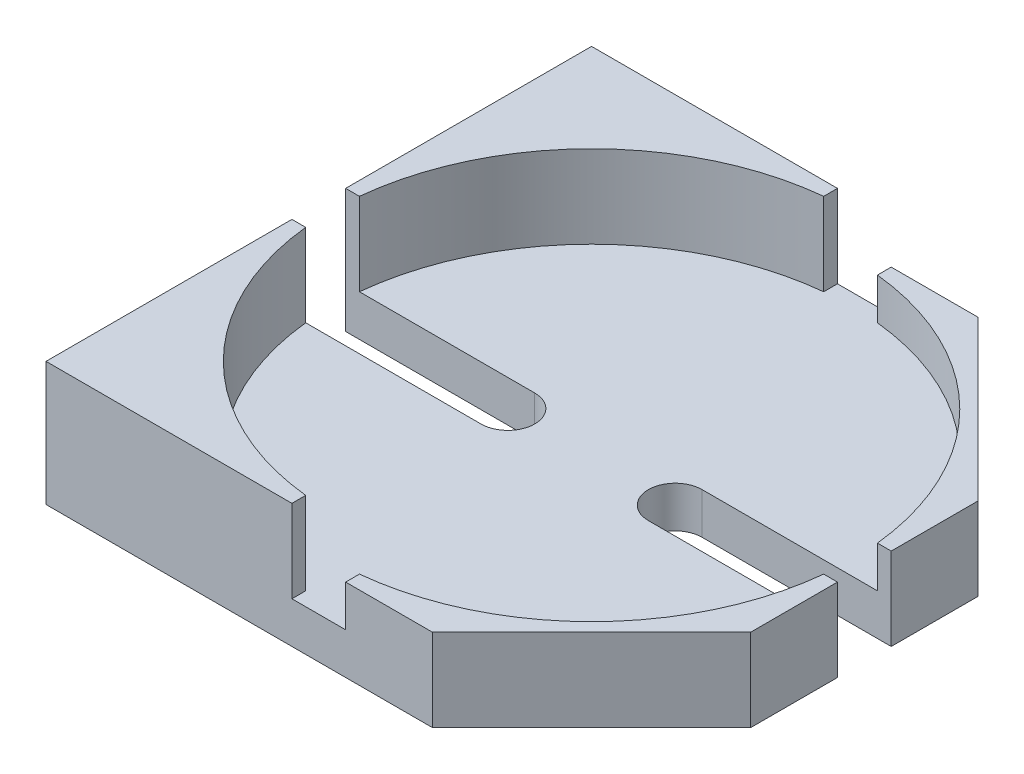
ISO-10303-21;
HEADER;
FILE_DESCRIPTION(('STEP AP214'),'2;1');
FILE_NAME('part.step','',(''),(''),'','','');
FILE_SCHEMA(('AUTOMOTIVE_DESIGN { 1 0 10303 214 1 1 1 1 }'));
ENDSEC;
DATA;
#1=APPLICATION_CONTEXT('core data for automotive mechanical design processes');
#2=APPLICATION_PROTOCOL_DEFINITION('international standard','automotive_design',2000,#1);
#3=PRODUCT_CONTEXT('',#1,'mechanical');
#4=PRODUCT('Part','Part','',(#3));
#5=PRODUCT_RELATED_PRODUCT_CATEGORY('part','',(#4));
#6=PRODUCT_DEFINITION_FORMATION('','',#4);
#7=PRODUCT_DEFINITION_CONTEXT('part definition',#1,'design');
#8=PRODUCT_DEFINITION('design','',#6,#7);
#9=PRODUCT_DEFINITION_SHAPE('','',#8);
#10=(LENGTH_UNIT() NAMED_UNIT(*) SI_UNIT(.MILLI.,.METRE.));
#11=(NAMED_UNIT(*) PLANE_ANGLE_UNIT() SI_UNIT($,.RADIAN.));
#12=(NAMED_UNIT(*) SI_UNIT($,.STERADIAN.) SOLID_ANGLE_UNIT());
#13=UNCERTAINTY_MEASURE_WITH_UNIT(LENGTH_MEASURE(1.E-05),#10,'distance_accuracy_value','');
#14=(GEOMETRIC_REPRESENTATION_CONTEXT(3) GLOBAL_UNCERTAINTY_ASSIGNED_CONTEXT((#13)) GLOBAL_UNIT_ASSIGNED_CONTEXT((#10,
#11,#12)) REPRESENTATION_CONTEXT('',''));
#15=CARTESIAN_POINT('',(0.,0.,0.));
#16=DIRECTION('',(0.,0.,1.));
#17=DIRECTION('',(1.,0.,0.));
#18=AXIS2_PLACEMENT_3D('',#15,#16,#17);
#19=CARTESIAN_POINT('',(0.,1.,0.));
#20=DIRECTION('',(0.,1.,0.));
#21=DIRECTION('',(1.,0.,0.));
#22=AXIS2_PLACEMENT_3D('',#19,#20,#21);
#23=PLANE('',#22);
#24=CARTESIAN_POINT('',(0.,1.,0.));
#25=DIRECTION('',(0.,1.,0.));
#26=DIRECTION('',(0.,0.,1.));
#27=AXIS2_PLACEMENT_3D('',#24,#25,#26);
#28=CIRCLE('',#27,3.15);
#29=CARTESIAN_POINT('',(0.325000000000011,1.,3.13318926973778));
#30=VERTEX_POINT('',#29);
#31=CARTESIAN_POINT('',(3.13318926973778,1.,0.325));
#32=VERTEX_POINT('',#31);
#33=EDGE_CURVE('E20',#30,#32,#28,.T.);
#34=ORIENTED_EDGE('',*,*,#33,.F.);
#35=DIRECTION('',(0.,0.,-1.));
#36=VECTOR('',#35,1.);
#37=CARTESIAN_POINT('',(0.325000000000011,1.,0.));
#38=LINE('',#37,#36);
#39=CARTESIAN_POINT('',(0.325000000000011,1.,3.3));
#40=VERTEX_POINT('',#39);
#41=EDGE_CURVE('E11',#40,#30,#38,.T.);
#42=ORIENTED_EDGE('',*,*,#41,.F.);
#43=DIRECTION('',(1.,0.,0.));
#44=VECTOR('',#43,1.);
#45=CARTESIAN_POINT('',(0.,1.,3.3));
#46=LINE('',#45,#44);
#47=CARTESIAN_POINT('',(1.37500000000002,1.,3.3));
#48=VERTEX_POINT('',#47);
#49=EDGE_CURVE('E322',#40,#48,#46,.T.);
#50=ORIENTED_EDGE('',*,*,#49,.T.);
#51=DIRECTION('',(0.707106781186544,0.,-0.707106781186552));
#52=VECTOR('',#51,1.);
#53=CARTESIAN_POINT('',(2.3375,1.,2.3375));
#54=LINE('',#53,#52);
#55=CARTESIAN_POINT('',(3.3,1.,1.375));
#56=VERTEX_POINT('',#55);
#57=EDGE_CURVE('E349',#48,#56,#54,.T.);
#58=ORIENTED_EDGE('',*,*,#57,.T.);
#59=DIRECTION('',(0.,0.,-1.));
#60=VECTOR('',#59,1.);
#61=CARTESIAN_POINT('',(3.3,1.,0.));
#62=LINE('',#61,#60);
#63=CARTESIAN_POINT('',(3.3,1.,0.325));
#64=VERTEX_POINT('',#63);
#65=EDGE_CURVE('E188',#56,#64,#62,.T.);
#66=ORIENTED_EDGE('',*,*,#65,.T.);
#67=DIRECTION('',(-1.,0.,0.));
#68=VECTOR('',#67,1.);
#69=CARTESIAN_POINT('',(0.,1.,0.325));
#70=LINE('',#69,#68);
#71=EDGE_CURVE('E184',#64,#32,#70,.T.);
#72=ORIENTED_EDGE('',*,*,#71,.T.);
#73=EDGE_LOOP('',(#34,#42,#50,#58,#66,#72));
#74=FACE_BOUND('',#73,.T.);
#75=ADVANCED_FACE('F17',(#74),#23,.T.);
#76=CARTESIAN_POINT('',(0.325000000000011,1.,0.));
#77=DIRECTION('',(-1.,0.,0.));
#78=DIRECTION('',(0.,0.,1.));
#79=AXIS2_PLACEMENT_3D('',#76,#77,#78);
#80=PLANE('',#79);
#81=DIRECTION('',(0.,0.,-1.));
#82=VECTOR('',#81,1.);
#83=CARTESIAN_POINT('',(0.325000000000011,0.5,0.));
#84=LINE('',#83,#82);
#85=CARTESIAN_POINT('',(0.325000000000011,0.5,3.3));
#86=VERTEX_POINT('',#85);
#87=CARTESIAN_POINT('',(0.325000000000011,0.5,3.13318926973778));
#88=VERTEX_POINT('',#87);
#89=EDGE_CURVE('E487',#86,#88,#84,.T.);
#90=ORIENTED_EDGE('',*,*,#89,.F.);
#91=DIRECTION('',(0.,-1.,0.));
#92=VECTOR('',#91,1.);
#93=CARTESIAN_POINT('',(0.325000000000011,1.,3.3));
#94=LINE('',#93,#92);
#95=EDGE_CURVE('E326',#40,#86,#94,.T.);
#96=ORIENTED_EDGE('',*,*,#95,.F.);
#97=ORIENTED_EDGE('',*,*,#41,.T.);
#98=DIRECTION('',(0.,-1.,0.));
#99=VECTOR('',#98,1.);
#100=CARTESIAN_POINT('',(0.325000000000011,1.,3.13318926973778));
#101=LINE('',#100,#99);
#102=EDGE_CURVE('E155',#30,#88,#101,.T.);
#103=ORIENTED_EDGE('',*,*,#102,.T.);
#104=EDGE_LOOP('',(#90,#96,#97,#103));
#105=FACE_BOUND('',#104,.T.);
#106=ADVANCED_FACE('F641',(#105),#80,.T.);
#107=CARTESIAN_POINT('',(0.,1.,0.));
#108=DIRECTION('',(0.,-1.,0.));
#109=DIRECTION('',(0.,0.,-1.));
#110=AXIS2_PLACEMENT_3D('',#107,#108,#109);
#111=CYLINDRICAL_SURFACE('',#110,3.15);
#112=CARTESIAN_POINT('',(0.,0.5,0.));
#113=DIRECTION('',(0.,1.,0.));
#114=DIRECTION('',(0.,0.,1.));
#115=AXIS2_PLACEMENT_3D('',#112,#113,#114);
#116=CIRCLE('',#115,3.15);
#117=CARTESIAN_POINT('',(3.13318926973778,0.5,0.325));
#118=VERTEX_POINT('',#117);
#119=EDGE_CURVE('E548',#88,#118,#116,.T.);
#120=ORIENTED_EDGE('',*,*,#119,.F.);
#121=ORIENTED_EDGE('',*,*,#102,.F.);
#122=ORIENTED_EDGE('',*,*,#33,.T.);
#123=DIRECTION('',(0.,-1.,0.));
#124=VECTOR('',#123,1.);
#125=CARTESIAN_POINT('',(3.13318926973778,1.,0.325));
#126=LINE('',#125,#124);
#127=EDGE_CURVE('E175',#32,#118,#126,.T.);
#128=ORIENTED_EDGE('',*,*,#127,.T.);
#129=EDGE_LOOP('',(#120,#121,#122,#128));
#130=FACE_BOUND('',#129,.T.);
#131=ADVANCED_FACE('F172',(#130),#111,.F.);
#132=CARTESIAN_POINT('',(0.,1.,0.));
#133=DIRECTION('',(0.,1.,0.));
#134=DIRECTION('',(1.,0.,0.));
#135=AXIS2_PLACEMENT_3D('',#132,#133,#134);
#136=PLANE('',#135);
#137=CARTESIAN_POINT('',(0.,1.,0.));
#138=DIRECTION('',(0.,1.,0.));
#139=DIRECTION('',(0.,0.,1.));
#140=AXIS2_PLACEMENT_3D('',#137,#138,#139);
#141=CIRCLE('',#140,3.15);
#142=CARTESIAN_POINT('',(3.13318926973778,1.,-0.325));
#143=VERTEX_POINT('',#142);
#144=CARTESIAN_POINT('',(0.325000000000005,1.,-3.13318926973778));
#145=VERTEX_POINT('',#144);
#146=EDGE_CURVE('E149',#143,#145,#141,.T.);
#147=ORIENTED_EDGE('',*,*,#146,.F.);
#148=DIRECTION('',(1.,0.,0.));
#149=VECTOR('',#148,1.);
#150=CARTESIAN_POINT('',(0.,1.,-0.325));
#151=LINE('',#150,#149);
#152=CARTESIAN_POINT('',(3.3,1.,-0.325));
#153=VERTEX_POINT('',#152);
#154=EDGE_CURVE('E227',#143,#153,#151,.T.);
#155=ORIENTED_EDGE('',*,*,#154,.T.);
#156=DIRECTION('',(0.,0.,-1.));
#157=VECTOR('',#156,1.);
#158=CARTESIAN_POINT('',(3.3,1.,0.));
#159=LINE('',#158,#157);
#160=CARTESIAN_POINT('',(3.3,1.,-1.375));
#161=VERTEX_POINT('',#160);
#162=EDGE_CURVE('E237',#153,#161,#159,.T.);
#163=ORIENTED_EDGE('',*,*,#162,.T.);
#164=DIRECTION('',(-0.707106781186549,0.,-0.707106781186546));
#165=VECTOR('',#164,1.);
#166=CARTESIAN_POINT('',(2.3375,1.,-2.3375));
#167=LINE('',#166,#165);
#168=CARTESIAN_POINT('',(1.375,1.,-3.3));
#169=VERTEX_POINT('',#168);
#170=EDGE_CURVE('E242',#161,#169,#167,.T.);
#171=ORIENTED_EDGE('',*,*,#170,.T.);
#172=DIRECTION('',(-1.,0.,0.));
#173=VECTOR('',#172,1.);
#174=CARTESIAN_POINT('',(0.,1.,-3.3));
#175=LINE('',#174,#173);
#176=CARTESIAN_POINT('',(0.325000000000005,1.,-3.3));
#177=VERTEX_POINT('',#176);
#178=EDGE_CURVE('E265',#169,#177,#175,.T.);
#179=ORIENTED_EDGE('',*,*,#178,.T.);
#180=DIRECTION('',(0.,0.,1.));
#181=VECTOR('',#180,1.);
#182=CARTESIAN_POINT('',(0.325000000000005,1.,0.));
#183=LINE('',#182,#181);
#184=EDGE_CURVE('E51',#177,#145,#183,.T.);
#185=ORIENTED_EDGE('',*,*,#184,.T.);
#186=EDGE_LOOP('',(#147,#155,#163,#171,#179,#185));
#187=FACE_BOUND('',#186,.T.);
#188=ADVANCED_FACE('F618',(#187),#136,.T.);
#189=CARTESIAN_POINT('',(0.325000000000005,1.,0.));
#190=DIRECTION('',(1.,0.,0.));
#191=DIRECTION('',(0.,1.,0.));
#192=AXIS2_PLACEMENT_3D('',#189,#190,#191);
#193=PLANE('',#192);
#194=DIRECTION('',(0.,0.,1.));
#195=VECTOR('',#194,1.);
#196=CARTESIAN_POINT('',(0.325000000000005,0.5,0.));
#197=LINE('',#196,#195);
#198=CARTESIAN_POINT('',(0.325000000000005,0.5,-3.3));
#199=VERTEX_POINT('',#198);
#200=CARTESIAN_POINT('',(0.325000000000005,0.5,-3.13318926973778));
#201=VERTEX_POINT('',#200);
#202=EDGE_CURVE('E520',#199,#201,#197,.T.);
#203=ORIENTED_EDGE('',*,*,#202,.T.);
#204=DIRECTION('',(0.,-1.,0.));
#205=VECTOR('',#204,1.);
#206=CARTESIAN_POINT('',(0.325000000000005,1.,-3.13318926973778));
#207=LINE('',#206,#205);
#208=EDGE_CURVE('E153',#145,#201,#207,.T.);
#209=ORIENTED_EDGE('',*,*,#208,.F.);
#210=ORIENTED_EDGE('',*,*,#184,.F.);
#211=DIRECTION('',(0.,-1.,0.));
#212=VECTOR('',#211,1.);
#213=CARTESIAN_POINT('',(0.325000000000005,1.,-3.3));
#214=LINE('',#213,#212);
#215=EDGE_CURVE('E261',#177,#199,#214,.T.);
#216=ORIENTED_EDGE('',*,*,#215,.T.);
#217=EDGE_LOOP('',(#203,#209,#210,#216));
#218=FACE_BOUND('',#217,.T.);
#219=ADVANCED_FACE('F617',(#218),#193,.F.);
#220=CARTESIAN_POINT('',(0.,1.,0.));
#221=DIRECTION('',(0.,-1.,0.));
#222=DIRECTION('',(0.,0.,-1.));
#223=AXIS2_PLACEMENT_3D('',#220,#221,#222);
#224=CYLINDRICAL_SURFACE('',#223,3.15);
#225=CARTESIAN_POINT('',(0.,0.5,0.));
#226=DIRECTION('',(0.,1.,0.));
#227=DIRECTION('',(0.,0.,1.));
#228=AXIS2_PLACEMENT_3D('',#225,#226,#227);
#229=CIRCLE('',#228,3.15);
#230=CARTESIAN_POINT('',(3.13318926973778,0.5,-0.325));
#231=VERTEX_POINT('',#230);
#232=EDGE_CURVE('E526',#231,#201,#229,.T.);
#233=ORIENTED_EDGE('',*,*,#232,.F.);
#234=DIRECTION('',(0.,-1.,0.));
#235=VECTOR('',#234,1.);
#236=CARTESIAN_POINT('',(3.13318926973778,1.,-0.325));
#237=LINE('',#236,#235);
#238=EDGE_CURVE('E228',#143,#231,#237,.T.);
#239=ORIENTED_EDGE('',*,*,#238,.F.);
#240=ORIENTED_EDGE('',*,*,#146,.T.);
#241=ORIENTED_EDGE('',*,*,#208,.T.);
#242=EDGE_LOOP('',(#233,#239,#240,#241));
#243=FACE_BOUND('',#242,.T.);
#244=ADVANCED_FACE('F654',(#243),#224,.F.);
#245=CARTESIAN_POINT('',(0.,1.5,0.));
#246=DIRECTION('',(0.,1.,0.));
#247=DIRECTION('',(1.,0.,0.));
#248=AXIS2_PLACEMENT_3D('',#245,#246,#247);
#249=PLANE('',#248);
#250=CARTESIAN_POINT('',(0.,1.5,0.));
#251=DIRECTION('',(0.,1.,0.));
#252=DIRECTION('',(0.,0.,1.));
#253=AXIS2_PLACEMENT_3D('',#250,#251,#252);
#254=CIRCLE('',#253,3.15);
#255=CARTESIAN_POINT('',(-3.13318926973778,1.5,0.325));
#256=VERTEX_POINT('',#255);
#257=CARTESIAN_POINT('',(-0.325,1.5,3.13318926973778));
#258=VERTEX_POINT('',#257);
#259=EDGE_CURVE('E108',#256,#258,#254,.T.);
#260=ORIENTED_EDGE('',*,*,#259,.F.);
#261=DIRECTION('',(-1.,0.,0.));
#262=VECTOR('',#261,1.);
#263=CARTESIAN_POINT('',(0.,1.5,0.325));
#264=LINE('',#263,#262);
#265=CARTESIAN_POINT('',(-3.3,1.5,0.325));
#266=VERTEX_POINT('',#265);
#267=EDGE_CURVE('E133',#256,#266,#264,.T.);
#268=ORIENTED_EDGE('',*,*,#267,.T.);
#269=DIRECTION('',(0.,0.,1.));
#270=VECTOR('',#269,1.);
#271=CARTESIAN_POINT('',(-3.3,1.5,0.));
#272=LINE('',#271,#270);
#273=CARTESIAN_POINT('',(-3.3,1.5,3.3));
#274=VERTEX_POINT('',#273);
#275=EDGE_CURVE('E314',#266,#274,#272,.T.);
#276=ORIENTED_EDGE('',*,*,#275,.T.);
#277=DIRECTION('',(1.,0.,0.));
#278=VECTOR('',#277,1.);
#279=CARTESIAN_POINT('',(0.,1.5,3.3));
#280=LINE('',#279,#278);
#281=CARTESIAN_POINT('',(-0.325,1.5,3.3));
#282=VERTEX_POINT('',#281);
#283=EDGE_CURVE('E337',#274,#282,#280,.T.);
#284=ORIENTED_EDGE('',*,*,#283,.T.);
#285=DIRECTION('',(0.,0.,-1.));
#286=VECTOR('',#285,1.);
#287=CARTESIAN_POINT('',(-0.325,1.5,0.));
#288=LINE('',#287,#286);
#289=EDGE_CURVE('E146',#282,#258,#288,.T.);
#290=ORIENTED_EDGE('',*,*,#289,.T.);
#291=EDGE_LOOP('',(#260,#268,#276,#284,#290));
#292=FACE_BOUND('',#291,.T.);
#293=ADVANCED_FACE('F657',(#292),#249,.T.);
#294=CARTESIAN_POINT('',(-0.325,1.5,0.));
#295=DIRECTION('',(-1.,0.,0.));
#296=DIRECTION('',(0.,0.,1.));
#297=AXIS2_PLACEMENT_3D('',#294,#295,#296);
#298=PLANE('',#297);
#299=DIRECTION('',(0.,0.,-1.));
#300=VECTOR('',#299,1.);
#301=CARTESIAN_POINT('',(-0.325,0.5,0.));
#302=LINE('',#301,#300);
#303=CARTESIAN_POINT('',(-0.325,0.5,3.3));
#304=VERTEX_POINT('',#303);
#305=CARTESIAN_POINT('',(-0.325,0.5,3.13318926973778));
#306=VERTEX_POINT('',#305);
#307=EDGE_CURVE('E488',#304,#306,#302,.T.);
#308=ORIENTED_EDGE('',*,*,#307,.T.);
#309=DIRECTION('',(0.,-1.,0.));
#310=VECTOR('',#309,1.);
#311=CARTESIAN_POINT('',(-0.325,1.5,3.13318926973778));
#312=LINE('',#311,#310);
#313=EDGE_CURVE('E142',#258,#306,#312,.T.);
#314=ORIENTED_EDGE('',*,*,#313,.F.);
#315=ORIENTED_EDGE('',*,*,#289,.F.);
#316=DIRECTION('',(0.,-1.,0.));
#317=VECTOR('',#316,1.);
#318=CARTESIAN_POINT('',(-0.325,1.5,3.3));
#319=LINE('',#318,#317);
#320=EDGE_CURVE('E333',#282,#304,#319,.T.);
#321=ORIENTED_EDGE('',*,*,#320,.T.);
#322=EDGE_LOOP('',(#308,#314,#315,#321));
#323=FACE_BOUND('',#322,.T.);
#324=ADVANCED_FACE('F660',(#323),#298,.F.);
#325=CARTESIAN_POINT('',(0.,1.5,0.));
#326=DIRECTION('',(0.,-1.,0.));
#327=DIRECTION('',(0.,0.,-1.));
#328=AXIS2_PLACEMENT_3D('',#325,#326,#327);
#329=CYLINDRICAL_SURFACE('',#328,3.15);
#330=CARTESIAN_POINT('',(0.,0.5,0.));
#331=DIRECTION('',(0.,1.,0.));
#332=DIRECTION('',(0.,0.,1.));
#333=AXIS2_PLACEMENT_3D('',#330,#331,#332);
#334=CIRCLE('',#333,3.15);
#335=CARTESIAN_POINT('',(-3.13318926973778,0.5,0.325));
#336=VERTEX_POINT('',#335);
#337=EDGE_CURVE('E493',#336,#306,#334,.T.);
#338=ORIENTED_EDGE('',*,*,#337,.F.);
#339=DIRECTION('',(0.,-1.,0.));
#340=VECTOR('',#339,1.);
#341=CARTESIAN_POINT('',(-3.13318926973778,1.5,0.325));
#342=LINE('',#341,#340);
#343=EDGE_CURVE('E126',#256,#336,#342,.T.);
#344=ORIENTED_EDGE('',*,*,#343,.F.);
#345=ORIENTED_EDGE('',*,*,#259,.T.);
#346=ORIENTED_EDGE('',*,*,#313,.T.);
#347=EDGE_LOOP('',(#338,#344,#345,#346));
#348=FACE_BOUND('',#347,.T.);
#349=ADVANCED_FACE('F665',(#348),#329,.F.);
#350=CARTESIAN_POINT('',(0.,1.5,0.));
#351=DIRECTION('',(0.,1.,0.));
#352=DIRECTION('',(1.,0.,0.));
#353=AXIS2_PLACEMENT_3D('',#350,#351,#352);
#354=PLANE('',#353);
#355=CARTESIAN_POINT('',(0.,1.5,0.));
#356=DIRECTION('',(0.,1.,0.));
#357=DIRECTION('',(0.,0.,1.));
#358=AXIS2_PLACEMENT_3D('',#355,#356,#357);
#359=CIRCLE('',#358,3.15);
#360=CARTESIAN_POINT('',(-0.325000000000007,1.5,-3.13318926973778));
#361=VERTEX_POINT('',#360);
#362=CARTESIAN_POINT('',(-3.13318926973778,1.5,-0.325));
#363=VERTEX_POINT('',#362);
#364=EDGE_CURVE('E109',#361,#363,#359,.T.);
#365=ORIENTED_EDGE('',*,*,#364,.F.);
#366=DIRECTION('',(0.,0.,1.));
#367=VECTOR('',#366,1.);
#368=CARTESIAN_POINT('',(-0.325000000000009,1.5,0.));
#369=LINE('',#368,#367);
#370=CARTESIAN_POINT('',(-0.325000000000007,1.5,-3.3));
#371=VERTEX_POINT('',#370);
#372=EDGE_CURVE('E94',#371,#361,#369,.T.);
#373=ORIENTED_EDGE('',*,*,#372,.F.);
#374=DIRECTION('',(-1.,0.,0.));
#375=VECTOR('',#374,1.);
#376=CARTESIAN_POINT('',(0.,1.5,-3.3));
#377=LINE('',#376,#375);
#378=CARTESIAN_POINT('',(-3.3,1.5,-3.3));
#379=VERTEX_POINT('',#378);
#380=EDGE_CURVE('E255',#371,#379,#377,.T.);
#381=ORIENTED_EDGE('',*,*,#380,.T.);
#382=DIRECTION('',(0.,0.,1.));
#383=VECTOR('',#382,1.);
#384=CARTESIAN_POINT('',(-3.3,1.5,0.));
#385=LINE('',#384,#383);
#386=CARTESIAN_POINT('',(-3.3,1.5,-0.325));
#387=VERTEX_POINT('',#386);
#388=EDGE_CURVE('E275',#379,#387,#385,.T.);
#389=ORIENTED_EDGE('',*,*,#388,.T.);
#390=DIRECTION('',(1.,0.,0.));
#391=VECTOR('',#390,1.);
#392=CARTESIAN_POINT('',(0.,1.5,-0.325));
#393=LINE('',#392,#391);
#394=EDGE_CURVE('E115',#387,#363,#393,.T.);
#395=ORIENTED_EDGE('',*,*,#394,.T.);
#396=EDGE_LOOP('',(#365,#373,#381,#389,#395));
#397=FACE_BOUND('',#396,.T.);
#398=ADVANCED_FACE('F112',(#397),#354,.T.);
#399=CARTESIAN_POINT('',(-0.325000000000009,1.5,0.));
#400=DIRECTION('',(1.,0.,0.));
#401=DIRECTION('',(0.,0.,1.));
#402=AXIS2_PLACEMENT_3D('',#399,#400,#401);
#403=PLANE('',#402);
#404=DIRECTION('',(0.,0.,1.));
#405=VECTOR('',#404,1.);
#406=CARTESIAN_POINT('',(-0.325000000000009,0.5,0.));
#407=LINE('',#406,#405);
#408=CARTESIAN_POINT('',(-0.325000000000007,0.5,-3.3));
#409=VERTEX_POINT('',#408);
#410=CARTESIAN_POINT('',(-0.325000000000007,0.5,-3.13318926973778));
#411=VERTEX_POINT('',#410);
#412=EDGE_CURVE('E505',#409,#411,#407,.T.);
#413=ORIENTED_EDGE('',*,*,#412,.F.);
#414=DIRECTION('',(0.,-1.,0.));
#415=VECTOR('',#414,1.);
#416=CARTESIAN_POINT('',(-0.325000000000007,1.5,-3.3));
#417=LINE('',#416,#415);
#418=EDGE_CURVE('E103',#371,#409,#417,.T.);
#419=ORIENTED_EDGE('',*,*,#418,.F.);
#420=ORIENTED_EDGE('',*,*,#372,.T.);
#421=DIRECTION('',(0.,-1.,0.));
#422=VECTOR('',#421,1.);
#423=CARTESIAN_POINT('',(-0.325000000000007,1.5,-3.13318926973778));
#424=LINE('',#423,#422);
#425=EDGE_CURVE('E100',#361,#411,#424,.T.);
#426=ORIENTED_EDGE('',*,*,#425,.T.);
#427=EDGE_LOOP('',(#413,#419,#420,#426));
#428=FACE_BOUND('',#427,.T.);
#429=ADVANCED_FACE('F97',(#428),#403,.T.);
#430=CARTESIAN_POINT('',(0.,1.5,0.));
#431=DIRECTION('',(0.,-1.,0.));
#432=DIRECTION('',(0.,0.,-1.));
#433=AXIS2_PLACEMENT_3D('',#430,#431,#432);
#434=CYLINDRICAL_SURFACE('',#433,3.15);
#435=CARTESIAN_POINT('',(0.,0.5,0.));
#436=DIRECTION('',(0.,1.,0.));
#437=DIRECTION('',(0.,0.,1.));
#438=AXIS2_PLACEMENT_3D('',#435,#436,#437);
#439=CIRCLE('',#438,3.15);
#440=CARTESIAN_POINT('',(-3.13318926973778,0.5,-0.325));
#441=VERTEX_POINT('',#440);
#442=EDGE_CURVE('E123',#411,#441,#439,.T.);
#443=ORIENTED_EDGE('',*,*,#442,.F.);
#444=ORIENTED_EDGE('',*,*,#425,.F.);
#445=ORIENTED_EDGE('',*,*,#364,.T.);
#446=DIRECTION('',(0.,-1.,0.));
#447=VECTOR('',#446,1.);
#448=CARTESIAN_POINT('',(-3.13318926973778,1.5,-0.325));
#449=LINE('',#448,#447);
#450=EDGE_CURVE('E284',#363,#441,#449,.T.);
#451=ORIENTED_EDGE('',*,*,#450,.T.);
#452=EDGE_LOOP('',(#443,#444,#445,#451));
#453=FACE_BOUND('',#452,.T.);
#454=ADVANCED_FACE('F121',(#453),#434,.F.);
#455=CARTESIAN_POINT('',(1.0125,0.,0.));
#456=DIRECTION('',(0.,1.,0.));
#457=DIRECTION('',(1.,0.,0.));
#458=AXIS2_PLACEMENT_3D('',#455,#456,#457);
#459=PLANE('',#458);
#460=DIRECTION('',(0.,0.,1.));
#461=VECTOR('',#460,1.);
#462=CARTESIAN_POINT('',(-3.3,0.,0.325));
#463=LINE('',#462,#461);
#464=CARTESIAN_POINT('',(-3.3,0.,0.325));
#465=VERTEX_POINT('',#464);
#466=CARTESIAN_POINT('',(-3.3,0.,3.3));
#467=VERTEX_POINT('',#466);
#468=EDGE_CURVE('E483',#465,#467,#463,.T.);
#469=ORIENTED_EDGE('',*,*,#468,.F.);
#470=DIRECTION('',(-1.,0.,0.));
#471=VECTOR('',#470,1.);
#472=CARTESIAN_POINT('',(-1.0125,0.,0.325));
#473=LINE('',#472,#471);
#474=CARTESIAN_POINT('',(-1.0125,0.,0.325));
#475=VERTEX_POINT('',#474);
#476=EDGE_CURVE('E136',#475,#465,#473,.T.);
#477=ORIENTED_EDGE('',*,*,#476,.F.);
#478=CARTESIAN_POINT('',(-1.0125,0.,0.));
#479=DIRECTION('',(0.,-1.,0.));
#480=DIRECTION('',(0.,0.,1.));
#481=AXIS2_PLACEMENT_3D('',#478,#479,#480);
#482=CIRCLE('',#481,0.325);
#483=CARTESIAN_POINT('',(-1.0125,0.,-0.325));
#484=VERTEX_POINT('',#483);
#485=EDGE_CURVE('E288',#484,#475,#482,.T.);
#486=ORIENTED_EDGE('',*,*,#485,.F.);
#487=DIRECTION('',(1.,0.,0.));
#488=VECTOR('',#487,1.);
#489=CARTESIAN_POINT('',(-1.0125,0.,-0.325));
#490=LINE('',#489,#488);
#491=CARTESIAN_POINT('',(-3.3,0.,-0.325));
#492=VERTEX_POINT('',#491);
#493=EDGE_CURVE('E279',#492,#484,#490,.T.);
#494=ORIENTED_EDGE('',*,*,#493,.F.);
#495=DIRECTION('',(0.,0.,1.));
#496=VECTOR('',#495,1.);
#497=CARTESIAN_POINT('',(-3.3,0.,-3.3));
#498=LINE('',#497,#496);
#499=CARTESIAN_POINT('',(-3.3,0.,-3.3));
#500=VERTEX_POINT('',#499);
#501=EDGE_CURVE('E268',#500,#492,#498,.T.);
#502=ORIENTED_EDGE('',*,*,#501,.F.);
#503=DIRECTION('',(-1.,0.,0.));
#504=VECTOR('',#503,1.);
#505=CARTESIAN_POINT('',(1.375,0.,-3.3));
#506=LINE('',#505,#504);
#507=CARTESIAN_POINT('',(1.375,0.,-3.3));
#508=VERTEX_POINT('',#507);
#509=EDGE_CURVE('E247',#508,#500,#506,.T.);
#510=ORIENTED_EDGE('',*,*,#509,.F.);
#511=DIRECTION('',(-0.707106781186549,0.,-0.707106781186546));
#512=VECTOR('',#511,1.);
#513=CARTESIAN_POINT('',(1.375,0.,-3.3));
#514=LINE('',#513,#512);
#515=CARTESIAN_POINT('',(3.3,0.,-1.375));
#516=VERTEX_POINT('',#515);
#517=EDGE_CURVE('E243',#516,#508,#514,.T.);
#518=ORIENTED_EDGE('',*,*,#517,.F.);
#519=DIRECTION('',(0.,0.,-1.));
#520=VECTOR('',#519,1.);
#521=CARTESIAN_POINT('',(3.3,0.,-1.375));
#522=LINE('',#521,#520);
#523=CARTESIAN_POINT('',(3.3,0.,-0.325));
#524=VERTEX_POINT('',#523);
#525=EDGE_CURVE('E232',#524,#516,#522,.T.);
#526=ORIENTED_EDGE('',*,*,#525,.F.);
#527=DIRECTION('',(1.,0.,0.));
#528=VECTOR('',#527,1.);
#529=CARTESIAN_POINT('',(1.0125,0.,-0.325));
#530=LINE('',#529,#528);
#531=CARTESIAN_POINT('',(1.0125,0.,-0.325));
#532=VERTEX_POINT('',#531);
#533=EDGE_CURVE('E219',#532,#524,#530,.T.);
#534=ORIENTED_EDGE('',*,*,#533,.F.);
#535=CARTESIAN_POINT('',(1.0125,0.,0.));
#536=DIRECTION('',(0.,-1.,0.));
#537=DIRECTION('',(0.,0.,1.));
#538=AXIS2_PLACEMENT_3D('',#535,#536,#537);
#539=CIRCLE('',#538,0.325);
#540=CARTESIAN_POINT('',(1.0125,0.,0.325));
#541=VERTEX_POINT('',#540);
#542=EDGE_CURVE('E193',#541,#532,#539,.T.);
#543=ORIENTED_EDGE('',*,*,#542,.F.);
#544=DIRECTION('',(-1.,0.,0.));
#545=VECTOR('',#544,1.);
#546=CARTESIAN_POINT('',(1.0125,0.,0.325));
#547=LINE('',#546,#545);
#548=CARTESIAN_POINT('',(3.3,0.,0.325));
#549=VERTEX_POINT('',#548);
#550=EDGE_CURVE('E208',#549,#541,#547,.T.);
#551=ORIENTED_EDGE('',*,*,#550,.F.);
#552=DIRECTION('',(0.,0.,-1.));
#553=VECTOR('',#552,1.);
#554=CARTESIAN_POINT('',(3.3,0.,0.325));
#555=LINE('',#554,#553);
#556=CARTESIAN_POINT('',(3.3,0.,1.375));
#557=VERTEX_POINT('',#556);
#558=EDGE_CURVE('E345',#557,#549,#555,.T.);
#559=ORIENTED_EDGE('',*,*,#558,.F.);
#560=DIRECTION('',(0.707106781186544,0.,-0.707106781186552));
#561=VECTOR('',#560,1.);
#562=CARTESIAN_POINT('',(1.37500000000002,0.,3.3));
#563=LINE('',#562,#561);
#564=CARTESIAN_POINT('',(1.37500000000002,0.,3.3));
#565=VERTEX_POINT('',#564);
#566=EDGE_CURVE('E341',#565,#557,#563,.T.);
#567=ORIENTED_EDGE('',*,*,#566,.F.);
#568=DIRECTION('',(1.,0.,0.));
#569=VECTOR('',#568,1.);
#570=CARTESIAN_POINT('',(1.37500000000002,0.,3.3));
#571=LINE('',#570,#569);
#572=EDGE_CURVE('E313',#467,#565,#571,.T.);
#573=ORIENTED_EDGE('',*,*,#572,.F.);
#574=EDGE_LOOP('',(#469,#477,#486,#494,#502,#510,#518,#526,#534,#543,#551,#559,#567,#573));
#575=FACE_BOUND('',#574,.T.);
#576=ADVANCED_FACE('F379',(#575),#459,.F.);
#577=CARTESIAN_POINT('',(-1.0125,0.5,0.325));
#578=DIRECTION('',(0.,0.,1.));
#579=DIRECTION('',(1.,0.,0.));
#580=AXIS2_PLACEMENT_3D('',#577,#578,#579);
#581=PLANE('',#580);
#582=ORIENTED_EDGE('',*,*,#476,.T.);
#583=DIRECTION('',(0.,-1.,0.));
#584=VECTOR('',#583,1.);
#585=CARTESIAN_POINT('',(-3.3,0.5,0.325));
#586=LINE('',#585,#584);
#587=EDGE_CURVE('E309',#266,#465,#586,.T.);
#588=ORIENTED_EDGE('',*,*,#587,.F.);
#589=ORIENTED_EDGE('',*,*,#267,.F.);
#590=ORIENTED_EDGE('',*,*,#343,.T.);
#591=DIRECTION('',(-1.,0.,0.));
#592=VECTOR('',#591,1.);
#593=CARTESIAN_POINT('',(-1.0125,0.5,0.325));
#594=LINE('',#593,#592);
#595=CARTESIAN_POINT('',(-1.0125,0.5,0.325));
#596=VERTEX_POINT('',#595);
#597=EDGE_CURVE('E498',#596,#336,#594,.T.);
#598=ORIENTED_EDGE('',*,*,#597,.F.);
#599=DIRECTION('',(0.,-1.,0.));
#600=VECTOR('',#599,1.);
#601=CARTESIAN_POINT('',(-1.0125,0.5,0.325));
#602=LINE('',#601,#600);
#603=EDGE_CURVE('E289',#596,#475,#602,.T.);
#604=ORIENTED_EDGE('',*,*,#603,.T.);
#605=EDGE_LOOP('',(#582,#588,#589,#590,#598,#604));
#606=FACE_BOUND('',#605,.T.);
#607=ADVANCED_FACE('F608',(#606),#581,.F.);
#608=CARTESIAN_POINT('',(-1.0125,0.5,0.));
#609=DIRECTION('',(0.,-1.,0.));
#610=DIRECTION('',(0.,0.,-1.));
#611=AXIS2_PLACEMENT_3D('',#608,#609,#610);
#612=CYLINDRICAL_SURFACE('',#611,0.325);
#613=ORIENTED_EDGE('',*,*,#485,.T.);
#614=ORIENTED_EDGE('',*,*,#603,.F.);
#615=CARTESIAN_POINT('',(-1.0125,0.5,0.));
#616=DIRECTION('',(0.,-1.,0.));
#617=DIRECTION('',(0.,0.,1.));
#618=AXIS2_PLACEMENT_3D('',#615,#616,#617);
#619=CIRCLE('',#618,0.325);
#620=CARTESIAN_POINT('',(-1.0125,0.5,-0.325));
#621=VERTEX_POINT('',#620);
#622=EDGE_CURVE('E494',#621,#596,#619,.T.);
#623=ORIENTED_EDGE('',*,*,#622,.F.);
#624=DIRECTION('',(0.,-1.,0.));
#625=VECTOR('',#624,1.);
#626=CARTESIAN_POINT('',(-1.0125,0.5,-0.325));
#627=LINE('',#626,#625);
#628=EDGE_CURVE('E280',#621,#484,#627,.T.);
#629=ORIENTED_EDGE('',*,*,#628,.T.);
#630=EDGE_LOOP('',(#613,#614,#623,#629));
#631=FACE_BOUND('',#630,.T.);
#632=ADVANCED_FACE('F607',(#631),#612,.F.);
#633=CARTESIAN_POINT('',(-1.0125,0.5,-0.325));
#634=DIRECTION('',(0.,0.,-1.));
#635=DIRECTION('',(-1.,0.,0.));
#636=AXIS2_PLACEMENT_3D('',#633,#634,#635);
#637=PLANE('',#636);
#638=ORIENTED_EDGE('',*,*,#493,.T.);
#639=ORIENTED_EDGE('',*,*,#628,.F.);
#640=DIRECTION('',(1.,0.,0.));
#641=VECTOR('',#640,1.);
#642=CARTESIAN_POINT('',(-1.0125,0.5,-0.325));
#643=LINE('',#642,#641);
#644=EDGE_CURVE('E499',#441,#621,#643,.T.);
#645=ORIENTED_EDGE('',*,*,#644,.F.);
#646=ORIENTED_EDGE('',*,*,#450,.F.);
#647=ORIENTED_EDGE('',*,*,#394,.F.);
#648=DIRECTION('',(0.,-1.,0.));
#649=VECTOR('',#648,1.);
#650=CARTESIAN_POINT('',(-3.3,0.5,-0.325));
#651=LINE('',#650,#649);
#652=EDGE_CURVE('E272',#387,#492,#651,.T.);
#653=ORIENTED_EDGE('',*,*,#652,.T.);
#654=EDGE_LOOP('',(#638,#639,#645,#646,#647,#653));
#655=FACE_BOUND('',#654,.T.);
#656=ADVANCED_FACE('F612',(#655),#637,.F.);
#657=CARTESIAN_POINT('',(-3.3,0.5,-3.3));
#658=DIRECTION('',(1.,0.,0.));
#659=DIRECTION('',(0.,1.,0.));
#660=AXIS2_PLACEMENT_3D('',#657,#658,#659);
#661=PLANE('',#660);
#662=ORIENTED_EDGE('',*,*,#501,.T.);
#663=ORIENTED_EDGE('',*,*,#652,.F.);
#664=ORIENTED_EDGE('',*,*,#388,.F.);
#665=DIRECTION('',(0.,-1.,0.));
#666=VECTOR('',#665,1.);
#667=CARTESIAN_POINT('',(-3.3,0.5,-3.3));
#668=LINE('',#667,#666);
#669=EDGE_CURVE('E251',#379,#500,#668,.T.);
#670=ORIENTED_EDGE('',*,*,#669,.T.);
#671=EDGE_LOOP('',(#662,#663,#664,#670));
#672=FACE_BOUND('',#671,.T.);
#673=ADVANCED_FACE('F468',(#672),#661,.F.);
#674=CARTESIAN_POINT('',(1.375,0.5,-3.3));
#675=DIRECTION('',(0.,0.,1.));
#676=DIRECTION('',(1.,0.,0.));
#677=AXIS2_PLACEMENT_3D('',#674,#675,#676);
#678=PLANE('',#677);
#679=ORIENTED_EDGE('',*,*,#509,.T.);
#680=ORIENTED_EDGE('',*,*,#669,.F.);
#681=ORIENTED_EDGE('',*,*,#380,.F.);
#682=ORIENTED_EDGE('',*,*,#418,.T.);
#683=DIRECTION('',(-1.,0.,0.));
#684=VECTOR('',#683,1.);
#685=CARTESIAN_POINT('',(1.375,0.5,-3.3));
#686=LINE('',#685,#684);
#687=EDGE_CURVE('E516',#199,#409,#686,.T.);
#688=ORIENTED_EDGE('',*,*,#687,.F.);
#689=ORIENTED_EDGE('',*,*,#215,.F.);
#690=ORIENTED_EDGE('',*,*,#178,.F.);
#691=DIRECTION('',(0.,-1.,0.));
#692=VECTOR('',#691,1.);
#693=CARTESIAN_POINT('',(1.375,0.5,-3.3));
#694=LINE('',#693,#692);
#695=EDGE_CURVE('E238',#169,#508,#694,.T.);
#696=ORIENTED_EDGE('',*,*,#695,.T.);
#697=EDGE_LOOP('',(#679,#680,#681,#682,#688,#689,#690,#696));
#698=FACE_BOUND('',#697,.T.);
#699=ADVANCED_FACE('F469',(#698),#678,.F.);
#700=CARTESIAN_POINT('',(1.375,0.5,-3.3));
#701=DIRECTION('',(-0.707106781186546,0.,0.707106781186549));
#702=DIRECTION('',(0.,1.,0.));
#703=AXIS2_PLACEMENT_3D('',#700,#701,#702);
#704=PLANE('',#703);
#705=ORIENTED_EDGE('',*,*,#517,.T.);
#706=ORIENTED_EDGE('',*,*,#695,.F.);
#707=ORIENTED_EDGE('',*,*,#170,.F.);
#708=DIRECTION('',(0.,-1.,0.));
#709=VECTOR('',#708,1.);
#710=CARTESIAN_POINT('',(3.3,0.5,-1.375));
#711=LINE('',#710,#709);
#712=EDGE_CURVE('E233',#161,#516,#711,.T.);
#713=ORIENTED_EDGE('',*,*,#712,.T.);
#714=EDGE_LOOP('',(#705,#706,#707,#713));
#715=FACE_BOUND('',#714,.T.);
#716=ADVANCED_FACE('F473',(#715),#704,.F.);
#717=CARTESIAN_POINT('',(3.3,0.5,-1.375));
#718=DIRECTION('',(-1.,0.,0.));
#719=DIRECTION('',(0.,0.,1.));
#720=AXIS2_PLACEMENT_3D('',#717,#718,#719);
#721=PLANE('',#720);
#722=ORIENTED_EDGE('',*,*,#525,.T.);
#723=ORIENTED_EDGE('',*,*,#712,.F.);
#724=ORIENTED_EDGE('',*,*,#162,.F.);
#725=DIRECTION('',(0.,-1.,0.));
#726=VECTOR('',#725,1.);
#727=CARTESIAN_POINT('',(3.3,0.5,-0.325));
#728=LINE('',#727,#726);
#729=EDGE_CURVE('E223',#153,#524,#728,.T.);
#730=ORIENTED_EDGE('',*,*,#729,.T.);
#731=EDGE_LOOP('',(#722,#723,#724,#730));
#732=FACE_BOUND('',#731,.T.);
#733=ADVANCED_FACE('F622',(#732),#721,.F.);
#734=CARTESIAN_POINT('',(1.0125,0.5,-0.325));
#735=DIRECTION('',(0.,0.,-1.));
#736=DIRECTION('',(0.,-1.,0.));
#737=AXIS2_PLACEMENT_3D('',#734,#735,#736);
#738=PLANE('',#737);
#739=ORIENTED_EDGE('',*,*,#533,.T.);
#740=ORIENTED_EDGE('',*,*,#729,.F.);
#741=ORIENTED_EDGE('',*,*,#154,.F.);
#742=ORIENTED_EDGE('',*,*,#238,.T.);
#743=DIRECTION('',(1.,0.,0.));
#744=VECTOR('',#743,1.);
#745=CARTESIAN_POINT('',(1.0125,0.5,-0.325));
#746=LINE('',#745,#744);
#747=CARTESIAN_POINT('',(1.0125,0.5,-0.325));
#748=VERTEX_POINT('',#747);
#749=EDGE_CURVE('E530',#748,#231,#746,.T.);
#750=ORIENTED_EDGE('',*,*,#749,.F.);
#751=DIRECTION('',(0.,-1.,0.));
#752=VECTOR('',#751,1.);
#753=CARTESIAN_POINT('',(1.0125,0.5,-0.325));
#754=LINE('',#753,#752);
#755=EDGE_CURVE('E215',#748,#532,#754,.T.);
#756=ORIENTED_EDGE('',*,*,#755,.T.);
#757=EDGE_LOOP('',(#739,#740,#741,#742,#750,#756));
#758=FACE_BOUND('',#757,.T.);
#759=ADVANCED_FACE('F625',(#758),#738,.F.);
#760=CARTESIAN_POINT('',(1.0125,0.5,0.));
#761=DIRECTION('',(0.,-1.,0.));
#762=DIRECTION('',(0.,0.,-1.));
#763=AXIS2_PLACEMENT_3D('',#760,#761,#762);
#764=CYLINDRICAL_SURFACE('',#763,0.325);
#765=ORIENTED_EDGE('',*,*,#542,.T.);
#766=ORIENTED_EDGE('',*,*,#755,.F.);
#767=CARTESIAN_POINT('',(1.0125,0.5,0.));
#768=DIRECTION('',(0.,-1.,0.));
#769=DIRECTION('',(0.,0.,1.));
#770=AXIS2_PLACEMENT_3D('',#767,#768,#769);
#771=CIRCLE('',#770,0.325);
#772=CARTESIAN_POINT('',(1.0125,0.5,0.325));
#773=VERTEX_POINT('',#772);
#774=EDGE_CURVE('E534',#773,#748,#771,.T.);
#775=ORIENTED_EDGE('',*,*,#774,.F.);
#776=DIRECTION('',(0.,-1.,0.));
#777=VECTOR('',#776,1.);
#778=CARTESIAN_POINT('',(1.0125,0.5,0.325));
#779=LINE('',#778,#777);
#780=EDGE_CURVE('E202',#773,#541,#779,.T.);
#781=ORIENTED_EDGE('',*,*,#780,.T.);
#782=EDGE_LOOP('',(#765,#766,#775,#781));
#783=FACE_BOUND('',#782,.T.);
#784=ADVANCED_FACE('F627',(#783),#764,.F.);
#785=CARTESIAN_POINT('',(1.0125,0.5,0.325));
#786=DIRECTION('',(0.,0.,1.));
#787=DIRECTION('',(1.,0.,0.));
#788=AXIS2_PLACEMENT_3D('',#785,#786,#787);
#789=PLANE('',#788);
#790=ORIENTED_EDGE('',*,*,#550,.T.);
#791=ORIENTED_EDGE('',*,*,#780,.F.);
#792=DIRECTION('',(-1.,0.,0.));
#793=VECTOR('',#792,1.);
#794=CARTESIAN_POINT('',(1.0125,0.5,0.325));
#795=LINE('',#794,#793);
#796=EDGE_CURVE('E199',#118,#773,#795,.T.);
#797=ORIENTED_EDGE('',*,*,#796,.F.);
#798=ORIENTED_EDGE('',*,*,#127,.F.);
#799=ORIENTED_EDGE('',*,*,#71,.F.);
#800=DIRECTION('',(0.,-1.,0.));
#801=VECTOR('',#800,1.);
#802=CARTESIAN_POINT('',(3.3,0.5,0.325));
#803=LINE('',#802,#801);
#804=EDGE_CURVE('E329',#64,#549,#803,.T.);
#805=ORIENTED_EDGE('',*,*,#804,.T.);
#806=EDGE_LOOP('',(#790,#791,#797,#798,#799,#805));
#807=FACE_BOUND('',#806,.T.);
#808=ADVANCED_FACE('F196',(#807),#789,.F.);
#809=CARTESIAN_POINT('',(3.3,0.5,0.325));
#810=DIRECTION('',(-1.,0.,0.));
#811=DIRECTION('',(0.,0.,1.));
#812=AXIS2_PLACEMENT_3D('',#809,#810,#811);
#813=PLANE('',#812);
#814=ORIENTED_EDGE('',*,*,#558,.T.);
#815=ORIENTED_EDGE('',*,*,#804,.F.);
#816=ORIENTED_EDGE('',*,*,#65,.F.);
#817=DIRECTION('',(0.,-1.,0.));
#818=VECTOR('',#817,1.);
#819=CARTESIAN_POINT('',(3.3,0.5,1.375));
#820=LINE('',#819,#818);
#821=EDGE_CURVE('E352',#56,#557,#820,.T.);
#822=ORIENTED_EDGE('',*,*,#821,.T.);
#823=EDGE_LOOP('',(#814,#815,#816,#822));
#824=FACE_BOUND('',#823,.T.);
#825=ADVANCED_FACE('F635',(#824),#813,.F.);
#826=CARTESIAN_POINT('',(1.37500000000002,0.5,3.3));
#827=DIRECTION('',(-0.707106781186552,0.,-0.707106781186544));
#828=DIRECTION('',(-0.707106781186544,0.,0.707106781186552));
#829=AXIS2_PLACEMENT_3D('',#826,#827,#828);
#830=PLANE('',#829);
#831=ORIENTED_EDGE('',*,*,#566,.T.);
#832=ORIENTED_EDGE('',*,*,#821,.F.);
#833=ORIENTED_EDGE('',*,*,#57,.F.);
#834=DIRECTION('',(0.,-1.,0.));
#835=VECTOR('',#834,1.);
#836=CARTESIAN_POINT('',(1.37500000000002,0.5,3.3));
#837=LINE('',#836,#835);
#838=EDGE_CURVE('E318',#48,#565,#837,.T.);
#839=ORIENTED_EDGE('',*,*,#838,.T.);
#840=EDGE_LOOP('',(#831,#832,#833,#839));
#841=FACE_BOUND('',#840,.T.);
#842=ADVANCED_FACE('F682',(#841),#830,.F.);
#843=CARTESIAN_POINT('',(1.37500000000002,0.5,3.3));
#844=DIRECTION('',(0.,0.,-1.));
#845=DIRECTION('',(0.,-1.,0.));
#846=AXIS2_PLACEMENT_3D('',#843,#844,#845);
#847=PLANE('',#846);
#848=ORIENTED_EDGE('',*,*,#572,.T.);
#849=ORIENTED_EDGE('',*,*,#838,.F.);
#850=ORIENTED_EDGE('',*,*,#49,.F.);
#851=ORIENTED_EDGE('',*,*,#95,.T.);
#852=DIRECTION('',(1.,0.,0.));
#853=VECTOR('',#852,1.);
#854=CARTESIAN_POINT('',(1.37500000000002,0.5,3.3));
#855=LINE('',#854,#853);
#856=EDGE_CURVE('E492',#304,#86,#855,.T.);
#857=ORIENTED_EDGE('',*,*,#856,.F.);
#858=ORIENTED_EDGE('',*,*,#320,.F.);
#859=ORIENTED_EDGE('',*,*,#283,.F.);
#860=DIRECTION('',(0.,-1.,0.));
#861=VECTOR('',#860,1.);
#862=CARTESIAN_POINT('',(-3.3,0.5,3.3));
#863=LINE('',#862,#861);
#864=EDGE_CURVE('E307',#274,#467,#863,.T.);
#865=ORIENTED_EDGE('',*,*,#864,.T.);
#866=EDGE_LOOP('',(#848,#849,#850,#851,#857,#858,#859,#865));
#867=FACE_BOUND('',#866,.T.);
#868=ADVANCED_FACE('F687',(#867),#847,.F.);
#869=CARTESIAN_POINT('',(-3.3,0.5,0.325));
#870=DIRECTION('',(1.,0.,0.));
#871=DIRECTION('',(0.,1.,0.));
#872=AXIS2_PLACEMENT_3D('',#869,#870,#871);
#873=PLANE('',#872);
#874=ORIENTED_EDGE('',*,*,#468,.T.);
#875=ORIENTED_EDGE('',*,*,#864,.F.);
#876=ORIENTED_EDGE('',*,*,#275,.F.);
#877=ORIENTED_EDGE('',*,*,#587,.T.);
#878=EDGE_LOOP('',(#874,#875,#876,#877));
#879=FACE_BOUND('',#878,.T.);
#880=ADVANCED_FACE('F699',(#879),#873,.F.);
#881=CARTESIAN_POINT('',(1.0125,0.5,0.));
#882=DIRECTION('',(0.,1.,0.));
#883=DIRECTION('',(1.,0.,0.));
#884=AXIS2_PLACEMENT_3D('',#881,#882,#883);
#885=PLANE('',#884);
#886=ORIENTED_EDGE('',*,*,#119,.T.);
#887=ORIENTED_EDGE('',*,*,#796,.T.);
#888=ORIENTED_EDGE('',*,*,#774,.T.);
#889=ORIENTED_EDGE('',*,*,#749,.T.);
#890=ORIENTED_EDGE('',*,*,#232,.T.);
#891=ORIENTED_EDGE('',*,*,#202,.F.);
#892=ORIENTED_EDGE('',*,*,#687,.T.);
#893=ORIENTED_EDGE('',*,*,#412,.T.);
#894=ORIENTED_EDGE('',*,*,#442,.T.);
#895=ORIENTED_EDGE('',*,*,#644,.T.);
#896=ORIENTED_EDGE('',*,*,#622,.T.);
#897=ORIENTED_EDGE('',*,*,#597,.T.);
#898=ORIENTED_EDGE('',*,*,#337,.T.);
#899=ORIENTED_EDGE('',*,*,#307,.F.);
#900=ORIENTED_EDGE('',*,*,#856,.T.);
#901=ORIENTED_EDGE('',*,*,#89,.T.);
#902=EDGE_LOOP('',(#886,#887,#888,#889,#890,#891,#892,#893,#894,#895,#896,#897,#898,#899,#900,#901));
#903=FACE_BOUND('',#902,.T.);
#904=ADVANCED_FACE('F553',(#903),#885,.T.);
#905=CLOSED_SHELL('',(#75,#106,#131,#188,#219,#244,#293,#324,#349,#398,#429,#454,#576,#607,#632,
#656,#673,#699,#716,#733,#759,#784,#808,#825,#842,#868,#880,#904));
#906=MANIFOLD_SOLID_BREP('B1',#905);
#907=ADVANCED_BREP_SHAPE_REPRESENTATION('',(#18,#906),#14);
#908=SHAPE_DEFINITION_REPRESENTATION(#9,#907);
ENDSEC;
END-ISO-10303-21;
